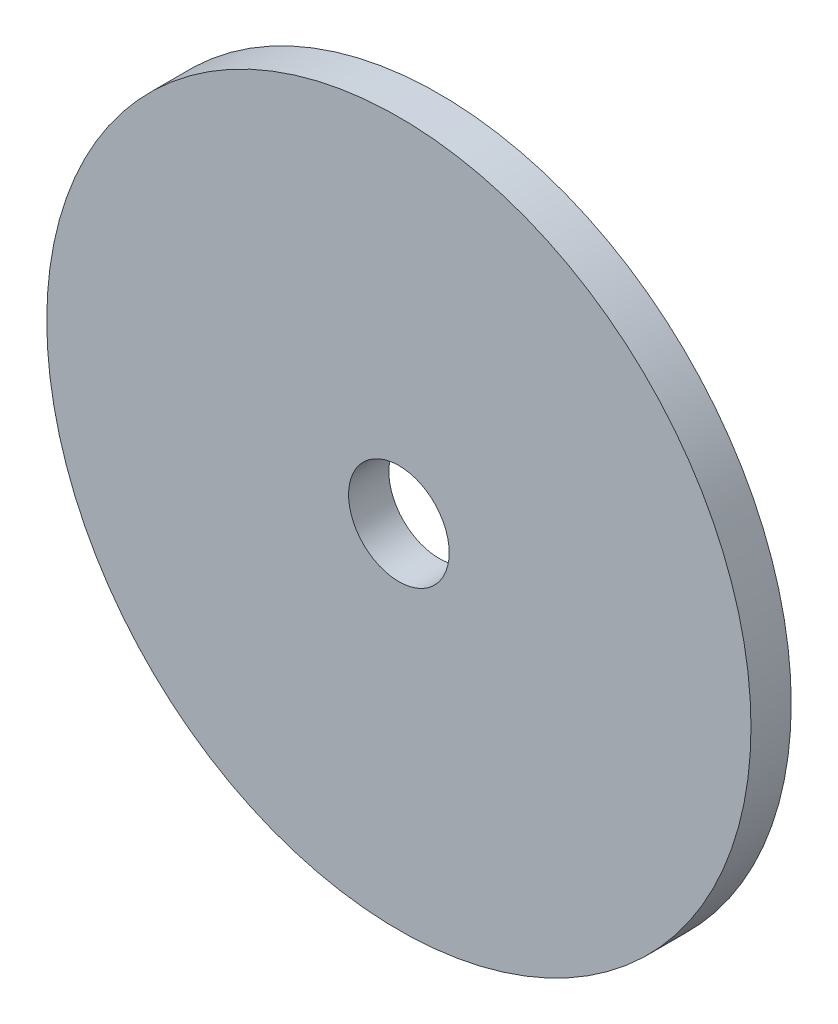
ISO-10303-21;
HEADER;
FILE_DESCRIPTION(('STEP AP214'),'2;1');
FILE_NAME('part.step','',(''),(''),'','','');
FILE_SCHEMA(('AUTOMOTIVE_DESIGN { 1 0 10303 214 1 1 1 1 }'));
ENDSEC;
DATA;
#1=APPLICATION_CONTEXT('core data for automotive mechanical design processes');
#2=APPLICATION_PROTOCOL_DEFINITION('international standard','automotive_design',2000,#1);
#3=PRODUCT_CONTEXT('',#1,'mechanical');
#4=PRODUCT('Part','Part','',(#3));
#5=PRODUCT_RELATED_PRODUCT_CATEGORY('part','',(#4));
#6=PRODUCT_DEFINITION_FORMATION('','',#4);
#7=PRODUCT_DEFINITION_CONTEXT('part definition',#1,'design');
#8=PRODUCT_DEFINITION('design','',#6,#7);
#9=PRODUCT_DEFINITION_SHAPE('','',#8);
#10=(LENGTH_UNIT() NAMED_UNIT(*) SI_UNIT(.MILLI.,.METRE.));
#11=(NAMED_UNIT(*) PLANE_ANGLE_UNIT() SI_UNIT($,.RADIAN.));
#12=(NAMED_UNIT(*) SI_UNIT($,.STERADIAN.) SOLID_ANGLE_UNIT());
#13=UNCERTAINTY_MEASURE_WITH_UNIT(LENGTH_MEASURE(1.E-05),#10,'distance_accuracy_value','');
#14=(GEOMETRIC_REPRESENTATION_CONTEXT(3) GLOBAL_UNCERTAINTY_ASSIGNED_CONTEXT((#13)) GLOBAL_UNIT_ASSIGNED_CONTEXT((#10,
#11,#12)) REPRESENTATION_CONTEXT('',''));
#15=CARTESIAN_POINT('',(0.,0.,0.));
#16=DIRECTION('',(0.,0.,1.));
#17=DIRECTION('',(1.,0.,0.));
#18=AXIS2_PLACEMENT_3D('',#15,#16,#17);
#19=CARTESIAN_POINT('',(0.,0.,0.));
#20=DIRECTION('',(0.,0.,1.));
#21=DIRECTION('',(1.,0.,0.));
#22=AXIS2_PLACEMENT_3D('',#19,#20,#21);
#23=CYLINDRICAL_SURFACE('',#22,5.);
#24=CARTESIAN_POINT('',(0.,0.,0.));
#25=DIRECTION('',(0.,0.,1.));
#26=DIRECTION('',(1.,0.,0.));
#27=AXIS2_PLACEMENT_3D('',#24,#25,#26);
#28=CIRCLE('',#27,5.);
#29=CARTESIAN_POINT('',(5.,0.,0.));
#30=VERTEX_POINT('',#29);
#31=EDGE_CURVE('E43',#30,#30,#28,.T.);
#32=ORIENTED_EDGE('',*,*,#31,.T.);
#33=EDGE_LOOP('',(#32));
#34=FACE_BOUND('',#33,.T.);
#35=CARTESIAN_POINT('',(0.,0.,-4.));
#36=DIRECTION('',(0.,0.,1.));
#37=DIRECTION('',(1.,0.,0.));
#38=AXIS2_PLACEMENT_3D('',#35,#36,#37);
#39=CIRCLE('',#38,5.);
#40=CARTESIAN_POINT('',(5.,0.,-4.));
#41=VERTEX_POINT('',#40);
#42=EDGE_CURVE('E49',#41,#41,#39,.T.);
#43=ORIENTED_EDGE('',*,*,#42,.F.);
#44=EDGE_LOOP('',(#43));
#45=FACE_BOUND('',#44,.T.);
#46=ADVANCED_FACE('F35',(#34,#45),#23,.F.);
#47=CARTESIAN_POINT('',(0.,0.,0.));
#48=DIRECTION('',(0.,0.,1.));
#49=DIRECTION('',(1.,0.,0.));
#50=AXIS2_PLACEMENT_3D('',#47,#48,#49);
#51=CYLINDRICAL_SURFACE('',#50,35.);
#52=CARTESIAN_POINT('',(0.,0.,0.));
#53=DIRECTION('',(0.,0.,1.));
#54=DIRECTION('',(1.,0.,0.));
#55=AXIS2_PLACEMENT_3D('',#52,#53,#54);
#56=CIRCLE('',#55,35.);
#57=CARTESIAN_POINT('',(35.,0.,0.));
#58=VERTEX_POINT('',#57);
#59=EDGE_CURVE('E10',#58,#58,#56,.T.);
#60=ORIENTED_EDGE('',*,*,#59,.F.);
#61=EDGE_LOOP('',(#60));
#62=FACE_BOUND('',#61,.T.);
#63=CARTESIAN_POINT('',(0.,0.,-4.));
#64=DIRECTION('',(0.,0.,1.));
#65=DIRECTION('',(1.,0.,0.));
#66=AXIS2_PLACEMENT_3D('',#63,#64,#65);
#67=CIRCLE('',#66,35.);
#68=CARTESIAN_POINT('',(35.,0.,-4.));
#69=VERTEX_POINT('',#68);
#70=EDGE_CURVE('E39',#69,#69,#67,.T.);
#71=ORIENTED_EDGE('',*,*,#70,.T.);
#72=EDGE_LOOP('',(#71));
#73=FACE_BOUND('',#72,.T.);
#74=ADVANCED_FACE('F37',(#62,#73),#51,.T.);
#75=CARTESIAN_POINT('',(0.,0.,0.));
#76=DIRECTION('',(0.,0.,1.));
#77=DIRECTION('',(1.,0.,0.));
#78=AXIS2_PLACEMENT_3D('',#75,#76,#77);
#79=PLANE('',#78);
#80=ORIENTED_EDGE('',*,*,#31,.F.);
#81=EDGE_LOOP('',(#80));
#82=FACE_BOUND('',#81,.T.);
#83=ORIENTED_EDGE('',*,*,#59,.T.);
#84=EDGE_LOOP('',(#83));
#85=FACE_BOUND('',#84,.T.);
#86=ADVANCED_FACE('F59',(#82,#85),#79,.T.);
#87=CARTESIAN_POINT('',(0.,0.,-4.));
#88=DIRECTION('',(0.,0.,1.));
#89=DIRECTION('',(1.,0.,0.));
#90=AXIS2_PLACEMENT_3D('',#87,#88,#89);
#91=PLANE('',#90);
#92=ORIENTED_EDGE('',*,*,#42,.T.);
#93=EDGE_LOOP('',(#92));
#94=FACE_BOUND('',#93,.T.);
#95=ORIENTED_EDGE('',*,*,#70,.F.);
#96=EDGE_LOOP('',(#95));
#97=FACE_BOUND('',#96,.T.);
#98=ADVANCED_FACE('F57',(#94,#97),#91,.F.);
#99=CLOSED_SHELL('',(#46,#74,#86,#98));
#100=MANIFOLD_SOLID_BREP('B2',#99);
#101=ADVANCED_BREP_SHAPE_REPRESENTATION('',(#18,#100),#14);
#102=SHAPE_DEFINITION_REPRESENTATION(#9,#101);
ENDSEC;
END-ISO-10303-21;
